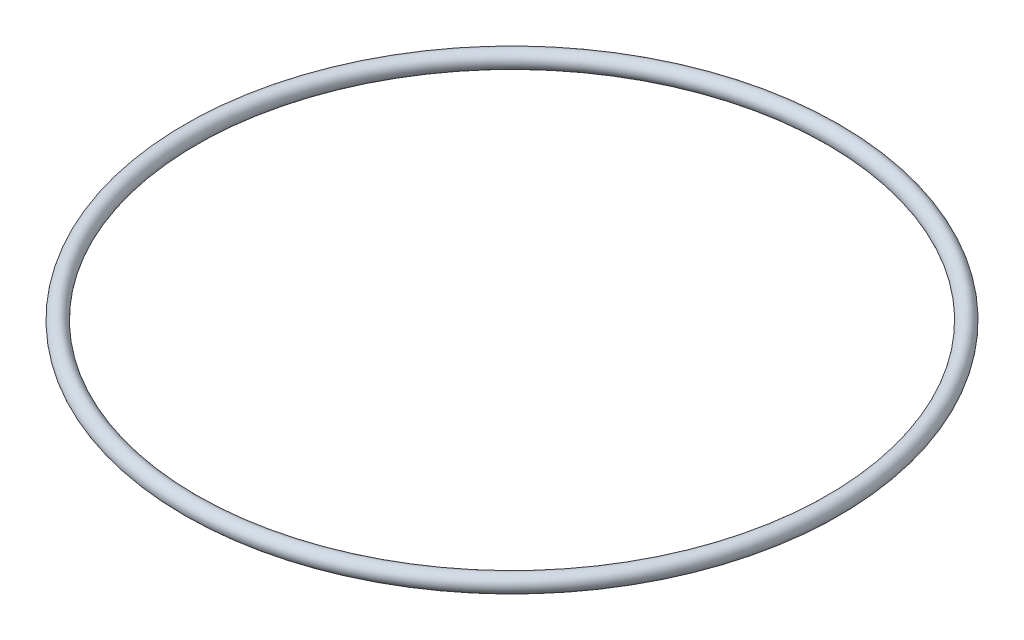
ISO-10303-21;
HEADER;
FILE_DESCRIPTION(('STEP AP214'),'2;1');
FILE_NAME('part.step','',(''),(''),'','','');
FILE_SCHEMA(('AUTOMOTIVE_DESIGN { 1 0 10303 214 1 1 1 1 }'));
ENDSEC;
DATA;
#1=APPLICATION_CONTEXT('core data for automotive mechanical design processes');
#2=APPLICATION_PROTOCOL_DEFINITION('international standard','automotive_design',2000,#1);
#3=PRODUCT_CONTEXT('',#1,'mechanical');
#4=PRODUCT('Part','Part','',(#3));
#5=PRODUCT_RELATED_PRODUCT_CATEGORY('part','',(#4));
#6=PRODUCT_DEFINITION_FORMATION('','',#4);
#7=PRODUCT_DEFINITION_CONTEXT('part definition',#1,'design');
#8=PRODUCT_DEFINITION('design','',#6,#7);
#9=PRODUCT_DEFINITION_SHAPE('','',#8);
#10=(LENGTH_UNIT() NAMED_UNIT(*) SI_UNIT(.MILLI.,.METRE.));
#11=(NAMED_UNIT(*) PLANE_ANGLE_UNIT() SI_UNIT($,.RADIAN.));
#12=(NAMED_UNIT(*) SI_UNIT($,.STERADIAN.) SOLID_ANGLE_UNIT());
#13=UNCERTAINTY_MEASURE_WITH_UNIT(LENGTH_MEASURE(1.E-05),#10,'distance_accuracy_value','');
#14=(GEOMETRIC_REPRESENTATION_CONTEXT(3) GLOBAL_UNCERTAINTY_ASSIGNED_CONTEXT((#13)) GLOBAL_UNIT_ASSIGNED_CONTEXT((#10,
#11,#12)) REPRESENTATION_CONTEXT('',''));
#15=CARTESIAN_POINT('',(0.,0.,0.));
#16=DIRECTION('',(0.,0.,1.));
#17=DIRECTION('',(1.,0.,0.));
#18=AXIS2_PLACEMENT_3D('',#15,#16,#17);
#19=CARTESIAN_POINT('',(0.,0.,0.));
#20=DIRECTION('',(0.,-1.,0.));
#21=DIRECTION('',(0.,0.,-1.));
#22=AXIS2_PLACEMENT_3D('',#19,#20,#21);
#23=TOROIDAL_SURFACE('',#22,46.101,1.190625);
#24=CARTESIAN_POINT('',(0.,0.,-47.291625));
#25=VERTEX_POINT('',#24);
#26=VERTEX_LOOP('',#25);
#27=FACE_BOUND('',#26,.T.);
#28=ADVANCED_FACE('F356',(#27),#23,.T.);
#29=CLOSED_SHELL('',(#28));
#30=MANIFOLD_SOLID_BREP('B2',#29);
#31=ADVANCED_BREP_SHAPE_REPRESENTATION('',(#18,#30),#14);
#32=SHAPE_DEFINITION_REPRESENTATION(#9,#31);
ENDSEC;
END-ISO-10303-21;
